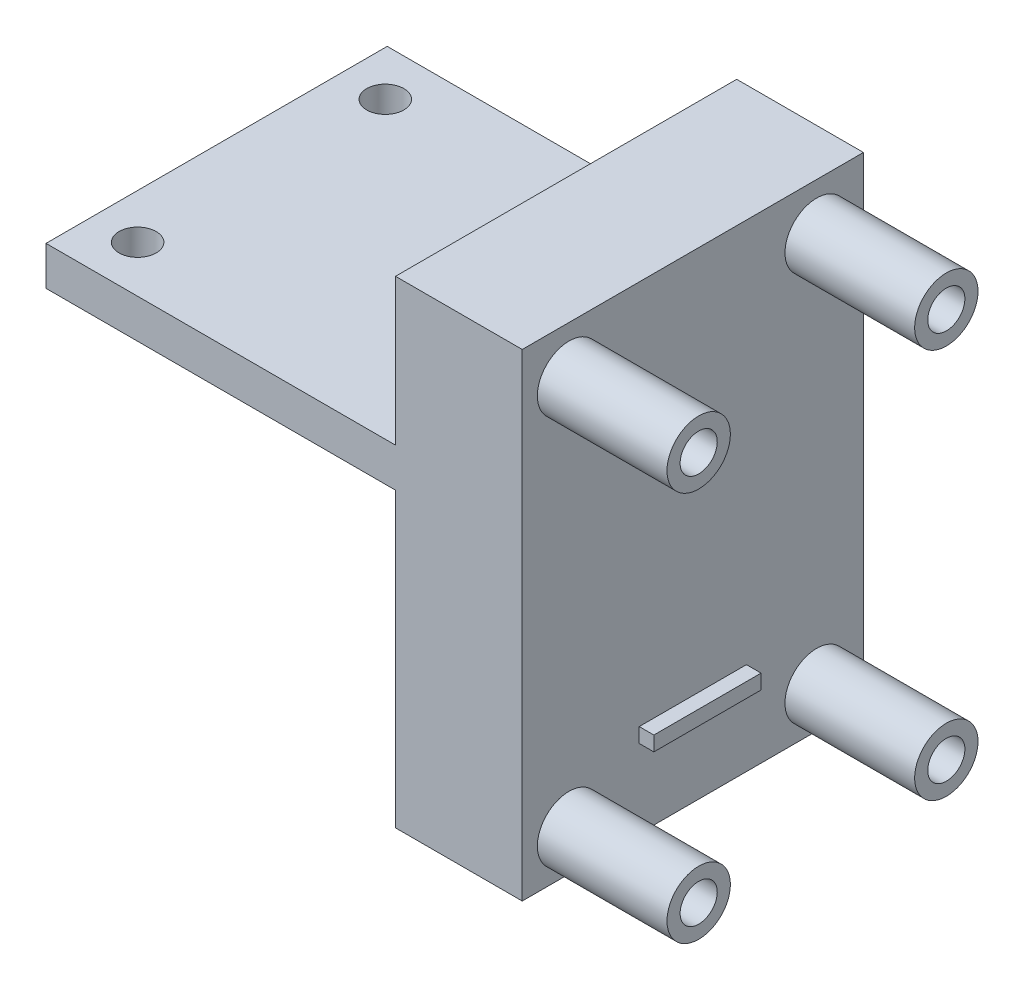
ISO-10303-21;
HEADER;
FILE_DESCRIPTION(('STEP AP214'),'2;1');
FILE_NAME('part.step','',(''),(''),'','','');
FILE_SCHEMA(('AUTOMOTIVE_DESIGN { 1 0 10303 214 1 1 1 1 }'));
ENDSEC;
DATA;
#1=APPLICATION_CONTEXT('core data for automotive mechanical design processes');
#2=APPLICATION_PROTOCOL_DEFINITION('international standard','automotive_design',2000,#1);
#3=PRODUCT_CONTEXT('',#1,'mechanical');
#4=PRODUCT('Part','Part','',(#3));
#5=PRODUCT_RELATED_PRODUCT_CATEGORY('part','',(#4));
#6=PRODUCT_DEFINITION_FORMATION('','',#4);
#7=PRODUCT_DEFINITION_CONTEXT('part definition',#1,'design');
#8=PRODUCT_DEFINITION('design','',#6,#7);
#9=PRODUCT_DEFINITION_SHAPE('','',#8);
#10=(LENGTH_UNIT() NAMED_UNIT(*) SI_UNIT(.MILLI.,.METRE.));
#11=(NAMED_UNIT(*) PLANE_ANGLE_UNIT() SI_UNIT($,.RADIAN.));
#12=(NAMED_UNIT(*) SI_UNIT($,.STERADIAN.) SOLID_ANGLE_UNIT());
#13=UNCERTAINTY_MEASURE_WITH_UNIT(LENGTH_MEASURE(1.E-05),#10,'distance_accuracy_value','');
#14=(GEOMETRIC_REPRESENTATION_CONTEXT(3) GLOBAL_UNCERTAINTY_ASSIGNED_CONTEXT((#13)) GLOBAL_UNIT_ASSIGNED_CONTEXT((#10,
#11,#12)) REPRESENTATION_CONTEXT('',''));
#15=CARTESIAN_POINT('',(0.,0.,0.));
#16=DIRECTION('',(0.,0.,1.));
#17=DIRECTION('',(1.,0.,0.));
#18=AXIS2_PLACEMENT_3D('',#15,#16,#17);
#19=CARTESIAN_POINT('',(13.,34.,-35.));
#20=DIRECTION('',(-1.,0.,0.));
#21=DIRECTION('',(0.,-1.,0.));
#22=AXIS2_PLACEMENT_3D('',#19,#20,#21);
#23=PLANE('',#22);
#24=CARTESIAN_POINT('',(13.,4.1,-30.2));
#25=DIRECTION('',(-1.,0.,0.));
#26=DIRECTION('',(0.,-1.,0.));
#27=AXIS2_PLACEMENT_3D('',#24,#25,#26);
#28=CIRCLE('',#27,3.25);
#29=CARTESIAN_POINT('',(13.,0.850000000000002,-30.2));
#30=VERTEX_POINT('',#29);
#31=EDGE_CURVE('E50',#30,#30,#28,.F.);
#32=ORIENTED_EDGE('',*,*,#31,.F.);
#33=EDGE_LOOP('',(#32));
#34=FACE_BOUND('',#33,.T.);
#35=CARTESIAN_POINT('',(13.,44.1,-4.8));
#36=DIRECTION('',(-1.,0.,0.));
#37=DIRECTION('',(0.,-1.,0.));
#38=AXIS2_PLACEMENT_3D('',#35,#36,#37);
#39=CIRCLE('',#38,3.25);
#40=CARTESIAN_POINT('',(13.,40.85,-4.8));
#41=VERTEX_POINT('',#40);
#42=EDGE_CURVE('E263',#41,#41,#39,.F.);
#43=ORIENTED_EDGE('',*,*,#42,.F.);
#44=EDGE_LOOP('',(#43));
#45=FACE_BOUND('',#44,.T.);
#46=DIRECTION('',(0.,-1.,0.));
#47=VECTOR('',#46,1.);
#48=CARTESIAN_POINT('',(13.,34.,0.));
#49=LINE('',#48,#47);
#50=CARTESIAN_POINT('',(13.,49.,0.));
#51=VERTEX_POINT('',#50);
#52=CARTESIAN_POINT('',(13.,0.,0.));
#53=VERTEX_POINT('',#52);
#54=EDGE_CURVE('E182',#51,#53,#49,.T.);
#55=ORIENTED_EDGE('',*,*,#54,.T.);
#56=DIRECTION('',(0.,0.,1.));
#57=VECTOR('',#56,1.);
#58=CARTESIAN_POINT('',(13.,0.,-35.));
#59=LINE('',#58,#57);
#60=CARTESIAN_POINT('',(13.,0.,-35.));
#61=VERTEX_POINT('',#60);
#62=EDGE_CURVE('E261',#61,#53,#59,.T.);
#63=ORIENTED_EDGE('',*,*,#62,.F.);
#64=DIRECTION('',(0.,-1.,0.));
#65=VECTOR('',#64,1.);
#66=CARTESIAN_POINT('',(13.,49.,-35.));
#67=LINE('',#66,#65);
#68=CARTESIAN_POINT('',(13.,49.,-35.));
#69=VERTEX_POINT('',#68);
#70=EDGE_CURVE('E183',#69,#61,#67,.T.);
#71=ORIENTED_EDGE('',*,*,#70,.F.);
#72=DIRECTION('',(0.,0.,1.));
#73=VECTOR('',#72,1.);
#74=CARTESIAN_POINT('',(13.,49.,-35.));
#75=LINE('',#74,#73);
#76=EDGE_CURVE('E209',#69,#51,#75,.T.);
#77=ORIENTED_EDGE('',*,*,#76,.T.);
#78=EDGE_LOOP('',(#55,#63,#71,#77));
#79=FACE_BOUND('',#78,.T.);
#80=DIRECTION('',(0.,-1.,0.));
#81=VECTOR('',#80,1.);
#82=CARTESIAN_POINT('',(13.,9.5,-12.));
#83=LINE('',#82,#81);
#84=CARTESIAN_POINT('',(13.,9.5,-12.));
#85=VERTEX_POINT('',#84);
#86=CARTESIAN_POINT('',(13.,8.,-12.));
#87=VERTEX_POINT('',#86);
#88=EDGE_CURVE('E153',#85,#87,#83,.T.);
#89=ORIENTED_EDGE('',*,*,#88,.F.);
#90=DIRECTION('',(0.,0.,1.));
#91=VECTOR('',#90,1.);
#92=CARTESIAN_POINT('',(13.,9.5,-23.));
#93=LINE('',#92,#91);
#94=CARTESIAN_POINT('',(13.,9.5,-23.));
#95=VERTEX_POINT('',#94);
#96=EDGE_CURVE('E150',#95,#85,#93,.T.);
#97=ORIENTED_EDGE('',*,*,#96,.F.);
#98=DIRECTION('',(0.,1.,0.));
#99=VECTOR('',#98,1.);
#100=CARTESIAN_POINT('',(13.,8.,-23.));
#101=LINE('',#100,#99);
#102=CARTESIAN_POINT('',(13.,8.,-23.));
#103=VERTEX_POINT('',#102);
#104=EDGE_CURVE('E62',#103,#95,#101,.T.);
#105=ORIENTED_EDGE('',*,*,#104,.F.);
#106=DIRECTION('',(0.,0.,-1.));
#107=VECTOR('',#106,1.);
#108=CARTESIAN_POINT('',(13.,8.,-12.));
#109=LINE('',#108,#107);
#110=EDGE_CURVE('E57',#87,#103,#109,.T.);
#111=ORIENTED_EDGE('',*,*,#110,.F.);
#112=EDGE_LOOP('',(#89,#97,#105,#111));
#113=FACE_BOUND('',#112,.T.);
#114=CARTESIAN_POINT('',(13.,44.1,-30.2));
#115=DIRECTION('',(-1.,0.,0.));
#116=DIRECTION('',(0.,-1.,0.));
#117=AXIS2_PLACEMENT_3D('',#114,#115,#116);
#118=CIRCLE('',#117,3.25);
#119=CARTESIAN_POINT('',(13.,40.85,-30.2));
#120=VERTEX_POINT('',#119);
#121=EDGE_CURVE('E280',#120,#120,#118,.F.);
#122=ORIENTED_EDGE('',*,*,#121,.F.);
#123=EDGE_LOOP('',(#122));
#124=FACE_BOUND('',#123,.T.);
#125=CARTESIAN_POINT('',(13.,4.1,-4.8));
#126=DIRECTION('',(-1.,0.,0.));
#127=DIRECTION('',(0.,-1.,0.));
#128=AXIS2_PLACEMENT_3D('',#125,#126,#127);
#129=CIRCLE('',#128,3.25);
#130=CARTESIAN_POINT('',(13.,0.850000000000004,-4.8));
#131=VERTEX_POINT('',#130);
#132=EDGE_CURVE('E11',#131,#131,#129,.F.);
#133=ORIENTED_EDGE('',*,*,#132,.F.);
#134=EDGE_LOOP('',(#133));
#135=FACE_BOUND('',#134,.T.);
#136=ADVANCED_FACE('F42',(#34,#45,#79,#113,#124,#135),#23,.F.);
#137=CARTESIAN_POINT('',(0.,0.,-35.));
#138=DIRECTION('',(0.,-1.,0.));
#139=DIRECTION('',(0.,0.,-1.));
#140=AXIS2_PLACEMENT_3D('',#137,#138,#139);
#141=PLANE('',#140);
#142=DIRECTION('',(1.,0.,0.));
#143=VECTOR('',#142,1.);
#144=CARTESIAN_POINT('',(0.,0.,0.));
#145=LINE('',#144,#143);
#146=CARTESIAN_POINT('',(0.,0.,0.));
#147=VERTEX_POINT('',#146);
#148=EDGE_CURVE('E213',#147,#53,#145,.T.);
#149=ORIENTED_EDGE('',*,*,#148,.F.);
#150=DIRECTION('',(0.,0.,1.));
#151=VECTOR('',#150,1.);
#152=CARTESIAN_POINT('',(0.,0.,-35.));
#153=LINE('',#152,#151);
#154=CARTESIAN_POINT('',(0.,0.,-35.));
#155=VERTEX_POINT('',#154);
#156=EDGE_CURVE('E258',#155,#147,#153,.T.);
#157=ORIENTED_EDGE('',*,*,#156,.F.);
#158=DIRECTION('',(1.,0.,0.));
#159=VECTOR('',#158,1.);
#160=CARTESIAN_POINT('',(0.,0.,-35.));
#161=LINE('',#160,#159);
#162=EDGE_CURVE('E186',#155,#61,#161,.T.);
#163=ORIENTED_EDGE('',*,*,#162,.T.);
#164=ORIENTED_EDGE('',*,*,#62,.T.);
#165=EDGE_LOOP('',(#149,#157,#163,#164));
#166=FACE_BOUND('',#165,.T.);
#167=ADVANCED_FACE('F291',(#166),#141,.T.);
#168=CARTESIAN_POINT('',(0.,0.,-35.));
#169=DIRECTION('',(1.,0.,0.));
#170=DIRECTION('',(0.,0.,-1.));
#171=AXIS2_PLACEMENT_3D('',#168,#169,#170);
#172=PLANE('',#171);
#173=CARTESIAN_POINT('',(0.,4.1,-4.8));
#174=DIRECTION('',(1.,0.,0.));
#175=DIRECTION('',(0.,0.,-1.));
#176=AXIS2_PLACEMENT_3D('',#173,#174,#175);
#177=CIRCLE('',#176,1.905);
#178=CARTESIAN_POINT('',(0.,4.1,-6.705));
#179=VERTEX_POINT('',#178);
#180=EDGE_CURVE('E160',#179,#179,#177,.T.);
#181=ORIENTED_EDGE('',*,*,#180,.T.);
#182=EDGE_LOOP('',(#181));
#183=FACE_BOUND('',#182,.T.);
#184=CARTESIAN_POINT('',(0.,4.1,-30.2));
#185=DIRECTION('',(1.,0.,0.));
#186=DIRECTION('',(0.,0.,-1.));
#187=AXIS2_PLACEMENT_3D('',#184,#185,#186);
#188=CIRCLE('',#187,1.905);
#189=CARTESIAN_POINT('',(0.,4.1,-32.105));
#190=VERTEX_POINT('',#189);
#191=EDGE_CURVE('E155',#190,#190,#188,.T.);
#192=ORIENTED_EDGE('',*,*,#191,.T.);
#193=EDGE_LOOP('',(#192));
#194=FACE_BOUND('',#193,.T.);
#195=DIRECTION('',(0.,1.,0.));
#196=VECTOR('',#195,1.);
#197=CARTESIAN_POINT('',(0.,0.,0.));
#198=LINE('',#197,#196);
#199=CARTESIAN_POINT('',(0.,30.,0.));
#200=VERTEX_POINT('',#199);
#201=EDGE_CURVE('E217',#147,#200,#198,.T.);
#202=ORIENTED_EDGE('',*,*,#201,.T.);
#203=DIRECTION('',(0.,0.,1.));
#204=VECTOR('',#203,1.);
#205=CARTESIAN_POINT('',(0.,30.,-35.));
#206=LINE('',#205,#204);
#207=CARTESIAN_POINT('',(0.,30.,-35.));
#208=VERTEX_POINT('',#207);
#209=EDGE_CURVE('E254',#208,#200,#206,.T.);
#210=ORIENTED_EDGE('',*,*,#209,.F.);
#211=DIRECTION('',(0.,1.,0.));
#212=VECTOR('',#211,1.);
#213=CARTESIAN_POINT('',(0.,0.,-35.));
#214=LINE('',#213,#212);
#215=EDGE_CURVE('E191',#155,#208,#214,.T.);
#216=ORIENTED_EDGE('',*,*,#215,.F.);
#217=ORIENTED_EDGE('',*,*,#156,.T.);
#218=EDGE_LOOP('',(#202,#210,#216,#217));
#219=FACE_BOUND('',#218,.T.);
#220=ADVANCED_FACE('F401',(#183,#194,#219),#172,.F.);
#221=CARTESIAN_POINT('',(0.,30.,-35.));
#222=DIRECTION('',(0.,1.,0.));
#223=DIRECTION('',(-1.,0.,0.));
#224=AXIS2_PLACEMENT_3D('',#221,#222,#223);
#225=PLANE('',#224);
#226=CARTESIAN_POINT('',(-31.25,30.,-4.8));
#227=DIRECTION('',(0.,1.,0.));
#228=DIRECTION('',(-1.,0.,0.));
#229=AXIS2_PLACEMENT_3D('',#226,#227,#228);
#230=CIRCLE('',#229,1.905);
#231=CARTESIAN_POINT('',(-33.155,30.,-4.8));
#232=VERTEX_POINT('',#231);
#233=EDGE_CURVE('E178',#232,#232,#230,.T.);
#234=ORIENTED_EDGE('',*,*,#233,.T.);
#235=EDGE_LOOP('',(#234));
#236=FACE_BOUND('',#235,.T.);
#237=CARTESIAN_POINT('',(-31.25,30.,-30.2));
#238=DIRECTION('',(0.,1.,0.));
#239=DIRECTION('',(-1.,0.,0.));
#240=AXIS2_PLACEMENT_3D('',#237,#238,#239);
#241=CIRCLE('',#240,1.905);
#242=CARTESIAN_POINT('',(-33.155,30.,-30.2));
#243=VERTEX_POINT('',#242);
#244=EDGE_CURVE('E170',#243,#243,#241,.T.);
#245=ORIENTED_EDGE('',*,*,#244,.T.);
#246=EDGE_LOOP('',(#245));
#247=FACE_BOUND('',#246,.T.);
#248=DIRECTION('',(-1.,0.,0.));
#249=VECTOR('',#248,1.);
#250=CARTESIAN_POINT('',(0.,30.,0.));
#251=LINE('',#250,#249);
#252=CARTESIAN_POINT('',(-35.85,30.,0.));
#253=VERTEX_POINT('',#252);
#254=EDGE_CURVE('E220',#200,#253,#251,.T.);
#255=ORIENTED_EDGE('',*,*,#254,.T.);
#256=DIRECTION('',(0.,0.,1.));
#257=VECTOR('',#256,1.);
#258=CARTESIAN_POINT('',(-35.85,30.,-35.));
#259=LINE('',#258,#257);
#260=CARTESIAN_POINT('',(-35.85,30.,-35.));
#261=VERTEX_POINT('',#260);
#262=EDGE_CURVE('E250',#261,#253,#259,.T.);
#263=ORIENTED_EDGE('',*,*,#262,.F.);
#264=DIRECTION('',(-1.,0.,0.));
#265=VECTOR('',#264,1.);
#266=CARTESIAN_POINT('',(0.,30.,-35.));
#267=LINE('',#266,#265);
#268=EDGE_CURVE('E194',#208,#261,#267,.T.);
#269=ORIENTED_EDGE('',*,*,#268,.F.);
#270=ORIENTED_EDGE('',*,*,#209,.T.);
#271=EDGE_LOOP('',(#255,#263,#269,#270));
#272=FACE_BOUND('',#271,.T.);
#273=ADVANCED_FACE('F397',(#236,#247,#272),#225,.F.);
#274=CARTESIAN_POINT('',(-35.85,30.,-35.));
#275=DIRECTION('',(1.,0.,0.));
#276=DIRECTION('',(0.,0.,-1.));
#277=AXIS2_PLACEMENT_3D('',#274,#275,#276);
#278=PLANE('',#277);
#279=DIRECTION('',(0.,1.,0.));
#280=VECTOR('',#279,1.);
#281=CARTESIAN_POINT('',(-35.85,30.,0.));
#282=LINE('',#281,#280);
#283=CARTESIAN_POINT('',(-35.85,34.,0.));
#284=VERTEX_POINT('',#283);
#285=EDGE_CURVE('E223',#253,#284,#282,.T.);
#286=ORIENTED_EDGE('',*,*,#285,.T.);
#287=DIRECTION('',(0.,0.,1.));
#288=VECTOR('',#287,1.);
#289=CARTESIAN_POINT('',(-35.85,34.,-35.));
#290=LINE('',#289,#288);
#291=CARTESIAN_POINT('',(-35.85,34.,-35.));
#292=VERTEX_POINT('',#291);
#293=EDGE_CURVE('E246',#292,#284,#290,.T.);
#294=ORIENTED_EDGE('',*,*,#293,.F.);
#295=DIRECTION('',(0.,1.,0.));
#296=VECTOR('',#295,1.);
#297=CARTESIAN_POINT('',(-35.85,30.,-35.));
#298=LINE('',#297,#296);
#299=EDGE_CURVE('E197',#261,#292,#298,.T.);
#300=ORIENTED_EDGE('',*,*,#299,.F.);
#301=ORIENTED_EDGE('',*,*,#262,.T.);
#302=EDGE_LOOP('',(#286,#294,#300,#301));
#303=FACE_BOUND('',#302,.T.);
#304=ADVANCED_FACE('F393',(#303),#278,.F.);
#305=CARTESIAN_POINT('',(-35.85,34.,-35.));
#306=DIRECTION('',(0.,-1.,0.));
#307=DIRECTION('',(1.,0.,0.));
#308=AXIS2_PLACEMENT_3D('',#305,#306,#307);
#309=PLANE('',#308);
#310=CARTESIAN_POINT('',(-31.25,34.,-4.8));
#311=DIRECTION('',(0.,1.,0.));
#312=DIRECTION('',(0.,0.,1.));
#313=AXIS2_PLACEMENT_3D('',#310,#311,#312);
#314=CIRCLE('',#313,1.905);
#315=CARTESIAN_POINT('',(-31.25,34.,-2.895));
#316=VERTEX_POINT('',#315);
#317=EDGE_CURVE('E166',#316,#316,#314,.T.);
#318=ORIENTED_EDGE('',*,*,#317,.F.);
#319=EDGE_LOOP('',(#318));
#320=FACE_BOUND('',#319,.T.);
#321=CARTESIAN_POINT('',(-31.25,34.,-30.2));
#322=DIRECTION('',(0.,1.,0.));
#323=DIRECTION('',(0.,0.,1.));
#324=AXIS2_PLACEMENT_3D('',#321,#322,#323);
#325=CIRCLE('',#324,1.905);
#326=CARTESIAN_POINT('',(-31.25,34.,-28.295));
#327=VERTEX_POINT('',#326);
#328=EDGE_CURVE('E171',#327,#327,#325,.T.);
#329=ORIENTED_EDGE('',*,*,#328,.F.);
#330=EDGE_LOOP('',(#329));
#331=FACE_BOUND('',#330,.T.);
#332=DIRECTION('',(1.,0.,0.));
#333=VECTOR('',#332,1.);
#334=CARTESIAN_POINT('',(-35.85,34.,0.));
#335=LINE('',#334,#333);
#336=CARTESIAN_POINT('',(0.,34.,0.));
#337=VERTEX_POINT('',#336);
#338=EDGE_CURVE('E226',#284,#337,#335,.T.);
#339=ORIENTED_EDGE('',*,*,#338,.T.);
#340=DIRECTION('',(0.,0.,1.));
#341=VECTOR('',#340,1.);
#342=CARTESIAN_POINT('',(0.,34.,-35.));
#343=LINE('',#342,#341);
#344=CARTESIAN_POINT('',(0.,34.,-35.));
#345=VERTEX_POINT('',#344);
#346=EDGE_CURVE('E242',#345,#337,#343,.T.);
#347=ORIENTED_EDGE('',*,*,#346,.F.);
#348=DIRECTION('',(1.,0.,0.));
#349=VECTOR('',#348,1.);
#350=CARTESIAN_POINT('',(-35.85,34.,-35.));
#351=LINE('',#350,#349);
#352=EDGE_CURVE('E200',#292,#345,#351,.T.);
#353=ORIENTED_EDGE('',*,*,#352,.F.);
#354=ORIENTED_EDGE('',*,*,#293,.T.);
#355=EDGE_LOOP('',(#339,#347,#353,#354));
#356=FACE_BOUND('',#355,.T.);
#357=ADVANCED_FACE('F389',(#320,#331,#356),#309,.F.);
#358=CARTESIAN_POINT('',(0.,34.,-35.));
#359=DIRECTION('',(1.,0.,0.));
#360=DIRECTION('',(0.,1.,0.));
#361=AXIS2_PLACEMENT_3D('',#358,#359,#360);
#362=PLANE('',#361);
#363=CARTESIAN_POINT('',(0.,44.1,-4.8));
#364=DIRECTION('',(1.,0.,0.));
#365=DIRECTION('',(0.,1.,0.));
#366=AXIS2_PLACEMENT_3D('',#363,#364,#365);
#367=CIRCLE('',#366,1.905);
#368=CARTESIAN_POINT('',(0.,46.005,-4.8));
#369=VERTEX_POINT('',#368);
#370=EDGE_CURVE('E272',#369,#369,#367,.T.);
#371=ORIENTED_EDGE('',*,*,#370,.T.);
#372=EDGE_LOOP('',(#371));
#373=FACE_BOUND('',#372,.T.);
#374=CARTESIAN_POINT('',(0.,44.1,-30.2));
#375=DIRECTION('',(1.,0.,0.));
#376=DIRECTION('',(0.,1.,0.));
#377=AXIS2_PLACEMENT_3D('',#374,#375,#376);
#378=CIRCLE('',#377,1.905);
#379=CARTESIAN_POINT('',(0.,46.005,-30.2));
#380=VERTEX_POINT('',#379);
#381=EDGE_CURVE('E268',#380,#380,#378,.T.);
#382=ORIENTED_EDGE('',*,*,#381,.T.);
#383=EDGE_LOOP('',(#382));
#384=FACE_BOUND('',#383,.T.);
#385=DIRECTION('',(0.,1.,0.));
#386=VECTOR('',#385,1.);
#387=CARTESIAN_POINT('',(0.,34.,0.));
#388=LINE('',#387,#386);
#389=CARTESIAN_POINT('',(0.,49.,0.));
#390=VERTEX_POINT('',#389);
#391=EDGE_CURVE('E229',#337,#390,#388,.T.);
#392=ORIENTED_EDGE('',*,*,#391,.T.);
#393=DIRECTION('',(0.,0.,1.));
#394=VECTOR('',#393,1.);
#395=CARTESIAN_POINT('',(0.,49.,-35.));
#396=LINE('',#395,#394);
#397=CARTESIAN_POINT('',(0.,49.,-35.));
#398=VERTEX_POINT('',#397);
#399=EDGE_CURVE('E238',#398,#390,#396,.T.);
#400=ORIENTED_EDGE('',*,*,#399,.F.);
#401=DIRECTION('',(0.,1.,0.));
#402=VECTOR('',#401,1.);
#403=CARTESIAN_POINT('',(0.,34.,-35.));
#404=LINE('',#403,#402);
#405=EDGE_CURVE('E203',#345,#398,#404,.T.);
#406=ORIENTED_EDGE('',*,*,#405,.F.);
#407=ORIENTED_EDGE('',*,*,#346,.T.);
#408=EDGE_LOOP('',(#392,#400,#406,#407));
#409=FACE_BOUND('',#408,.T.);
#410=ADVANCED_FACE('F385',(#373,#384,#409),#362,.F.);
#411=CARTESIAN_POINT('',(0.,49.,-35.));
#412=DIRECTION('',(0.,-1.,0.));
#413=DIRECTION('',(0.,0.,-1.));
#414=AXIS2_PLACEMENT_3D('',#411,#412,#413);
#415=PLANE('',#414);
#416=DIRECTION('',(1.,0.,0.));
#417=VECTOR('',#416,1.);
#418=CARTESIAN_POINT('',(0.,49.,0.));
#419=LINE('',#418,#417);
#420=EDGE_CURVE('E187',#390,#51,#419,.T.);
#421=ORIENTED_EDGE('',*,*,#420,.T.);
#422=ORIENTED_EDGE('',*,*,#76,.F.);
#423=DIRECTION('',(1.,0.,0.));
#424=VECTOR('',#423,1.);
#425=CARTESIAN_POINT('',(0.,49.,-35.));
#426=LINE('',#425,#424);
#427=EDGE_CURVE('E206',#398,#69,#426,.T.);
#428=ORIENTED_EDGE('',*,*,#427,.F.);
#429=ORIENTED_EDGE('',*,*,#399,.T.);
#430=EDGE_LOOP('',(#421,#422,#428,#429));
#431=FACE_BOUND('',#430,.T.);
#432=ADVANCED_FACE('F378',(#431),#415,.F.);
#433=CARTESIAN_POINT('',(0.,0.,-35.));
#434=DIRECTION('',(0.,0.,1.));
#435=DIRECTION('',(1.,0.,0.));
#436=AXIS2_PLACEMENT_3D('',#433,#434,#435);
#437=PLANE('',#436);
#438=ORIENTED_EDGE('',*,*,#70,.T.);
#439=ORIENTED_EDGE('',*,*,#162,.F.);
#440=ORIENTED_EDGE('',*,*,#215,.T.);
#441=ORIENTED_EDGE('',*,*,#268,.T.);
#442=ORIENTED_EDGE('',*,*,#299,.T.);
#443=ORIENTED_EDGE('',*,*,#352,.T.);
#444=ORIENTED_EDGE('',*,*,#405,.T.);
#445=ORIENTED_EDGE('',*,*,#427,.T.);
#446=EDGE_LOOP('',(#438,#439,#440,#441,#442,#443,#444,#445));
#447=FACE_BOUND('',#446,.T.);
#448=ADVANCED_FACE('F375',(#447),#437,.F.);
#449=CARTESIAN_POINT('',(0.,0.,0.));
#450=DIRECTION('',(0.,0.,1.));
#451=DIRECTION('',(1.,0.,0.));
#452=AXIS2_PLACEMENT_3D('',#449,#450,#451);
#453=PLANE('',#452);
#454=ORIENTED_EDGE('',*,*,#54,.F.);
#455=ORIENTED_EDGE('',*,*,#420,.F.);
#456=ORIENTED_EDGE('',*,*,#391,.F.);
#457=ORIENTED_EDGE('',*,*,#338,.F.);
#458=ORIENTED_EDGE('',*,*,#285,.F.);
#459=ORIENTED_EDGE('',*,*,#254,.F.);
#460=ORIENTED_EDGE('',*,*,#201,.F.);
#461=ORIENTED_EDGE('',*,*,#148,.T.);
#462=EDGE_LOOP('',(#454,#455,#456,#457,#458,#459,#460,#461));
#463=FACE_BOUND('',#462,.T.);
#464=ADVANCED_FACE('F373',(#463),#453,.T.);
#465=CARTESIAN_POINT('',(-31.25,0.,-30.2));
#466=DIRECTION('',(0.,1.,0.));
#467=DIRECTION('',(0.,0.,1.));
#468=AXIS2_PLACEMENT_3D('',#465,#466,#467);
#469=CYLINDRICAL_SURFACE('',#468,1.905);
#470=ORIENTED_EDGE('',*,*,#328,.T.);
#471=EDGE_LOOP('',(#470));
#472=FACE_BOUND('',#471,.T.);
#473=ORIENTED_EDGE('',*,*,#244,.F.);
#474=EDGE_LOOP('',(#473));
#475=FACE_BOUND('',#474,.T.);
#476=ADVANCED_FACE('F369',(#472,#475),#469,.F.);
#477=CARTESIAN_POINT('',(-31.25,0.,-4.8));
#478=DIRECTION('',(0.,1.,0.));
#479=DIRECTION('',(0.,0.,1.));
#480=AXIS2_PLACEMENT_3D('',#477,#478,#479);
#481=CYLINDRICAL_SURFACE('',#480,1.905);
#482=ORIENTED_EDGE('',*,*,#317,.T.);
#483=EDGE_LOOP('',(#482));
#484=FACE_BOUND('',#483,.T.);
#485=ORIENTED_EDGE('',*,*,#233,.F.);
#486=EDGE_LOOP('',(#485));
#487=FACE_BOUND('',#486,.T.);
#488=ADVANCED_FACE('F365',(#484,#487),#481,.F.);
#489=CARTESIAN_POINT('',(-35.85,4.1,-30.2));
#490=DIRECTION('',(1.,0.,0.));
#491=DIRECTION('',(0.,1.,0.));
#492=AXIS2_PLACEMENT_3D('',#489,#490,#491);
#493=CYLINDRICAL_SURFACE('',#492,1.905);
#494=ORIENTED_EDGE('',*,*,#191,.F.);
#495=EDGE_LOOP('',(#494));
#496=FACE_BOUND('',#495,.T.);
#497=CARTESIAN_POINT('',(26.3,4.10000000000001,-30.2));
#498=DIRECTION('',(1.,0.,0.));
#499=DIRECTION('',(0.,1.,0.));
#500=AXIS2_PLACEMENT_3D('',#497,#498,#499);
#501=CIRCLE('',#500,1.905);
#502=CARTESIAN_POINT('',(26.3,6.00500000000001,-30.2));
#503=VERTEX_POINT('',#502);
#504=EDGE_CURVE('E683',#503,#503,#501,.T.);
#505=ORIENTED_EDGE('',*,*,#504,.T.);
#506=EDGE_LOOP('',(#505));
#507=FACE_BOUND('',#506,.T.);
#508=ADVANCED_FACE('F361',(#496,#507),#493,.F.);
#509=CARTESIAN_POINT('',(-35.85,4.1,-4.8));
#510=DIRECTION('',(1.,0.,0.));
#511=DIRECTION('',(0.,1.,0.));
#512=AXIS2_PLACEMENT_3D('',#509,#510,#511);
#513=CYLINDRICAL_SURFACE('',#512,1.905);
#514=ORIENTED_EDGE('',*,*,#180,.F.);
#515=EDGE_LOOP('',(#514));
#516=FACE_BOUND('',#515,.T.);
#517=CARTESIAN_POINT('',(26.3,4.10000000000001,-4.8));
#518=DIRECTION('',(1.,0.,0.));
#519=DIRECTION('',(0.,1.,0.));
#520=AXIS2_PLACEMENT_3D('',#517,#518,#519);
#521=CIRCLE('',#520,1.905);
#522=CARTESIAN_POINT('',(26.3,6.00500000000001,-4.8));
#523=VERTEX_POINT('',#522);
#524=EDGE_CURVE('E695',#523,#523,#521,.T.);
#525=ORIENTED_EDGE('',*,*,#524,.T.);
#526=EDGE_LOOP('',(#525));
#527=FACE_BOUND('',#526,.T.);
#528=ADVANCED_FACE('F358',(#516,#527),#513,.F.);
#529=CARTESIAN_POINT('',(14.5,9.5,-12.));
#530=DIRECTION('',(0.,0.,-1.));
#531=DIRECTION('',(-1.,0.,0.));
#532=AXIS2_PLACEMENT_3D('',#529,#530,#531);
#533=PLANE('',#532);
#534=ORIENTED_EDGE('',*,*,#88,.T.);
#535=DIRECTION('',(-1.,0.,0.));
#536=VECTOR('',#535,1.);
#537=CARTESIAN_POINT('',(14.5,8.,-12.));
#538=LINE('',#537,#536);
#539=CARTESIAN_POINT('',(14.5,8.,-12.));
#540=VERTEX_POINT('',#539);
#541=EDGE_CURVE('E132',#540,#87,#538,.T.);
#542=ORIENTED_EDGE('',*,*,#541,.F.);
#543=DIRECTION('',(0.,-1.,0.));
#544=VECTOR('',#543,1.);
#545=CARTESIAN_POINT('',(14.5,9.5,-12.));
#546=LINE('',#545,#544);
#547=CARTESIAN_POINT('',(14.5,9.5,-12.));
#548=VERTEX_POINT('',#547);
#549=EDGE_CURVE('E140',#548,#540,#546,.T.);
#550=ORIENTED_EDGE('',*,*,#549,.F.);
#551=DIRECTION('',(-1.,0.,0.));
#552=VECTOR('',#551,1.);
#553=CARTESIAN_POINT('',(14.5,9.5,-12.));
#554=LINE('',#553,#552);
#555=EDGE_CURVE('E713',#548,#85,#554,.T.);
#556=ORIENTED_EDGE('',*,*,#555,.T.);
#557=EDGE_LOOP('',(#534,#542,#550,#556));
#558=FACE_BOUND('',#557,.T.);
#559=ADVANCED_FACE('F152',(#558),#533,.F.);
#560=CARTESIAN_POINT('',(14.5,8.,-12.));
#561=DIRECTION('',(0.,1.,0.));
#562=DIRECTION('',(-1.,0.,0.));
#563=AXIS2_PLACEMENT_3D('',#560,#561,#562);
#564=PLANE('',#563);
#565=ORIENTED_EDGE('',*,*,#110,.T.);
#566=DIRECTION('',(-1.,0.,0.));
#567=VECTOR('',#566,1.);
#568=CARTESIAN_POINT('',(14.5,8.,-23.));
#569=LINE('',#568,#567);
#570=CARTESIAN_POINT('',(14.5,8.,-23.));
#571=VERTEX_POINT('',#570);
#572=EDGE_CURVE('E135',#571,#103,#569,.T.);
#573=ORIENTED_EDGE('',*,*,#572,.F.);
#574=DIRECTION('',(0.,0.,-1.));
#575=VECTOR('',#574,1.);
#576=CARTESIAN_POINT('',(14.5,8.,-12.));
#577=LINE('',#576,#575);
#578=EDGE_CURVE('E128',#540,#571,#577,.T.);
#579=ORIENTED_EDGE('',*,*,#578,.F.);
#580=ORIENTED_EDGE('',*,*,#541,.T.);
#581=EDGE_LOOP('',(#565,#573,#579,#580));
#582=FACE_BOUND('',#581,.T.);
#583=ADVANCED_FACE('F130',(#582),#564,.F.);
#584=CARTESIAN_POINT('',(14.5,8.,-23.));
#585=DIRECTION('',(0.,0.,1.));
#586=DIRECTION('',(0.,-1.,0.));
#587=AXIS2_PLACEMENT_3D('',#584,#585,#586);
#588=PLANE('',#587);
#589=ORIENTED_EDGE('',*,*,#104,.T.);
#590=DIRECTION('',(-1.,0.,0.));
#591=VECTOR('',#590,1.);
#592=CARTESIAN_POINT('',(14.5,9.5,-23.));
#593=LINE('',#592,#591);
#594=CARTESIAN_POINT('',(14.5,9.5,-23.));
#595=VERTEX_POINT('',#594);
#596=EDGE_CURVE('E162',#595,#95,#593,.T.);
#597=ORIENTED_EDGE('',*,*,#596,.F.);
#598=DIRECTION('',(0.,1.,0.));
#599=VECTOR('',#598,1.);
#600=CARTESIAN_POINT('',(14.5,8.,-23.));
#601=LINE('',#600,#599);
#602=EDGE_CURVE('E139',#571,#595,#601,.T.);
#603=ORIENTED_EDGE('',*,*,#602,.F.);
#604=ORIENTED_EDGE('',*,*,#572,.T.);
#605=EDGE_LOOP('',(#589,#597,#603,#604));
#606=FACE_BOUND('',#605,.T.);
#607=ADVANCED_FACE('F349',(#606),#588,.F.);
#608=CARTESIAN_POINT('',(14.5,9.5,-23.));
#609=DIRECTION('',(0.,-1.,0.));
#610=DIRECTION('',(0.,0.,-1.));
#611=AXIS2_PLACEMENT_3D('',#608,#609,#610);
#612=PLANE('',#611);
#613=ORIENTED_EDGE('',*,*,#96,.T.);
#614=ORIENTED_EDGE('',*,*,#555,.F.);
#615=DIRECTION('',(0.,0.,1.));
#616=VECTOR('',#615,1.);
#617=CARTESIAN_POINT('',(14.5,9.5,-23.));
#618=LINE('',#617,#616);
#619=EDGE_CURVE('E145',#595,#548,#618,.T.);
#620=ORIENTED_EDGE('',*,*,#619,.F.);
#621=ORIENTED_EDGE('',*,*,#596,.T.);
#622=EDGE_LOOP('',(#613,#614,#620,#621));
#623=FACE_BOUND('',#622,.T.);
#624=ADVANCED_FACE('F346',(#623),#612,.F.);
#625=CARTESIAN_POINT('',(14.5,0.,0.));
#626=DIRECTION('',(1.,0.,0.));
#627=DIRECTION('',(0.,0.,-1.));
#628=AXIS2_PLACEMENT_3D('',#625,#626,#627);
#629=PLANE('',#628);
#630=ORIENTED_EDGE('',*,*,#549,.T.);
#631=ORIENTED_EDGE('',*,*,#578,.T.);
#632=ORIENTED_EDGE('',*,*,#602,.T.);
#633=ORIENTED_EDGE('',*,*,#619,.T.);
#634=EDGE_LOOP('',(#630,#631,#632,#633));
#635=FACE_BOUND('',#634,.T.);
#636=ADVANCED_FACE('F143',(#635),#629,.T.);
#637=CARTESIAN_POINT('',(-35.85,44.1,-30.2));
#638=DIRECTION('',(1.,0.,0.));
#639=DIRECTION('',(0.,1.,0.));
#640=AXIS2_PLACEMENT_3D('',#637,#638,#639);
#641=CYLINDRICAL_SURFACE('',#640,1.905);
#642=ORIENTED_EDGE('',*,*,#381,.F.);
#643=EDGE_LOOP('',(#642));
#644=FACE_BOUND('',#643,.T.);
#645=CARTESIAN_POINT('',(26.3,44.1,-30.2));
#646=DIRECTION('',(1.,0.,0.));
#647=DIRECTION('',(0.,1.,0.));
#648=AXIS2_PLACEMENT_3D('',#645,#646,#647);
#649=CIRCLE('',#648,1.905);
#650=CARTESIAN_POINT('',(26.3,46.005,-30.2));
#651=VERTEX_POINT('',#650);
#652=EDGE_CURVE('E692',#651,#651,#649,.T.);
#653=ORIENTED_EDGE('',*,*,#652,.T.);
#654=EDGE_LOOP('',(#653));
#655=FACE_BOUND('',#654,.T.);
#656=ADVANCED_FACE('F339',(#644,#655),#641,.F.);
#657=CARTESIAN_POINT('',(-35.85,44.1,-4.8));
#658=DIRECTION('',(1.,0.,0.));
#659=DIRECTION('',(0.,1.,0.));
#660=AXIS2_PLACEMENT_3D('',#657,#658,#659);
#661=CYLINDRICAL_SURFACE('',#660,1.905);
#662=ORIENTED_EDGE('',*,*,#370,.F.);
#663=EDGE_LOOP('',(#662));
#664=FACE_BOUND('',#663,.T.);
#665=CARTESIAN_POINT('',(26.3,44.1,-4.8));
#666=DIRECTION('',(1.,0.,0.));
#667=DIRECTION('',(0.,1.,0.));
#668=AXIS2_PLACEMENT_3D('',#665,#666,#667);
#669=CIRCLE('',#668,1.905);
#670=CARTESIAN_POINT('',(26.3,46.005,-4.8));
#671=VERTEX_POINT('',#670);
#672=EDGE_CURVE('E702',#671,#671,#669,.T.);
#673=ORIENTED_EDGE('',*,*,#672,.T.);
#674=EDGE_LOOP('',(#673));
#675=FACE_BOUND('',#674,.T.);
#676=ADVANCED_FACE('F332',(#664,#675),#661,.F.);
#677=CARTESIAN_POINT('',(26.3,44.1,-4.8));
#678=DIRECTION('',(1.,0.,0.));
#679=DIRECTION('',(0.,1.,0.));
#680=AXIS2_PLACEMENT_3D('',#677,#678,#679);
#681=PLANE('',#680);
#682=CARTESIAN_POINT('',(26.3,44.1,-4.8));
#683=DIRECTION('',(1.,0.,0.));
#684=DIRECTION('',(0.,1.,0.));
#685=AXIS2_PLACEMENT_3D('',#682,#683,#684);
#686=CIRCLE('',#685,3.25);
#687=CARTESIAN_POINT('',(26.3,47.35,-4.8));
#688=VERTEX_POINT('',#687);
#689=EDGE_CURVE('E273',#688,#688,#686,.T.);
#690=ORIENTED_EDGE('',*,*,#689,.T.);
#691=EDGE_LOOP('',(#690));
#692=FACE_BOUND('',#691,.T.);
#693=ORIENTED_EDGE('',*,*,#672,.F.);
#694=EDGE_LOOP('',(#693));
#695=FACE_BOUND('',#694,.T.);
#696=ADVANCED_FACE('F329',(#692,#695),#681,.T.);
#697=CARTESIAN_POINT('',(26.3,44.1,-4.8));
#698=DIRECTION('',(-1.,0.,0.));
#699=DIRECTION('',(0.,-1.,0.));
#700=AXIS2_PLACEMENT_3D('',#697,#698,#699);
#701=CYLINDRICAL_SURFACE('',#700,3.25);
#702=ORIENTED_EDGE('',*,*,#689,.F.);
#703=EDGE_LOOP('',(#702));
#704=FACE_BOUND('',#703,.T.);
#705=ORIENTED_EDGE('',*,*,#42,.T.);
#706=EDGE_LOOP('',(#705));
#707=FACE_BOUND('',#706,.T.);
#708=ADVANCED_FACE('F327',(#704,#707),#701,.T.);
#709=CARTESIAN_POINT('',(26.3,44.1,-30.2));
#710=DIRECTION('',(1.,0.,0.));
#711=DIRECTION('',(0.,1.,0.));
#712=AXIS2_PLACEMENT_3D('',#709,#710,#711);
#713=PLANE('',#712);
#714=CARTESIAN_POINT('',(26.3,44.1,-30.2));
#715=DIRECTION('',(1.,0.,0.));
#716=DIRECTION('',(0.,1.,0.));
#717=AXIS2_PLACEMENT_3D('',#714,#715,#716);
#718=CIRCLE('',#717,3.25);
#719=CARTESIAN_POINT('',(26.3,47.35,-30.2));
#720=VERTEX_POINT('',#719);
#721=EDGE_CURVE('E686',#720,#720,#718,.T.);
#722=ORIENTED_EDGE('',*,*,#721,.T.);
#723=EDGE_LOOP('',(#722));
#724=FACE_BOUND('',#723,.T.);
#725=ORIENTED_EDGE('',*,*,#652,.F.);
#726=EDGE_LOOP('',(#725));
#727=FACE_BOUND('',#726,.T.);
#728=ADVANCED_FACE('F323',(#724,#727),#713,.T.);
#729=CARTESIAN_POINT('',(26.3,44.1,-30.2));
#730=DIRECTION('',(-1.,0.,0.));
#731=DIRECTION('',(0.,-1.,0.));
#732=AXIS2_PLACEMENT_3D('',#729,#730,#731);
#733=CYLINDRICAL_SURFACE('',#732,3.25);
#734=ORIENTED_EDGE('',*,*,#721,.F.);
#735=EDGE_LOOP('',(#734));
#736=FACE_BOUND('',#735,.T.);
#737=ORIENTED_EDGE('',*,*,#121,.T.);
#738=EDGE_LOOP('',(#737));
#739=FACE_BOUND('',#738,.T.);
#740=ADVANCED_FACE('F319',(#736,#739),#733,.T.);
#741=CARTESIAN_POINT('',(26.3,4.10000000000001,-30.2));
#742=DIRECTION('',(1.,0.,0.));
#743=DIRECTION('',(0.,1.,0.));
#744=AXIS2_PLACEMENT_3D('',#741,#742,#743);
#745=PLANE('',#744);
#746=CARTESIAN_POINT('',(26.3,4.10000000000001,-30.2));
#747=DIRECTION('',(1.,0.,0.));
#748=DIRECTION('',(0.,1.,0.));
#749=AXIS2_PLACEMENT_3D('',#746,#747,#748);
#750=CIRCLE('',#749,3.25);
#751=CARTESIAN_POINT('',(26.3,7.35000000000001,-30.2));
#752=VERTEX_POINT('',#751);
#753=EDGE_CURVE('E687',#752,#752,#750,.T.);
#754=ORIENTED_EDGE('',*,*,#753,.T.);
#755=EDGE_LOOP('',(#754));
#756=FACE_BOUND('',#755,.T.);
#757=ORIENTED_EDGE('',*,*,#504,.F.);
#758=EDGE_LOOP('',(#757));
#759=FACE_BOUND('',#758,.T.);
#760=ADVANCED_FACE('F315',(#756,#759),#745,.T.);
#761=CARTESIAN_POINT('',(26.3,4.10000000000001,-30.2));
#762=DIRECTION('',(-1.,0.,0.));
#763=DIRECTION('',(0.,-1.,0.));
#764=AXIS2_PLACEMENT_3D('',#761,#762,#763);
#765=CYLINDRICAL_SURFACE('',#764,3.25);
#766=ORIENTED_EDGE('',*,*,#753,.F.);
#767=EDGE_LOOP('',(#766));
#768=FACE_BOUND('',#767,.T.);
#769=ORIENTED_EDGE('',*,*,#31,.T.);
#770=EDGE_LOOP('',(#769));
#771=FACE_BOUND('',#770,.T.);
#772=ADVANCED_FACE('F287',(#768,#771),#765,.T.);
#773=CARTESIAN_POINT('',(26.3,4.10000000000001,-4.8));
#774=DIRECTION('',(1.,0.,0.));
#775=DIRECTION('',(0.,1.,0.));
#776=AXIS2_PLACEMENT_3D('',#773,#774,#775);
#777=PLANE('',#776);
#778=CARTESIAN_POINT('',(26.3,4.10000000000001,-4.8));
#779=DIRECTION('',(1.,0.,0.));
#780=DIRECTION('',(0.,1.,0.));
#781=AXIS2_PLACEMENT_3D('',#778,#779,#780);
#782=CIRCLE('',#781,3.25);
#783=CARTESIAN_POINT('',(26.3,7.35000000000001,-4.8));
#784=VERTEX_POINT('',#783);
#785=EDGE_CURVE('E737',#784,#784,#782,.T.);
#786=ORIENTED_EDGE('',*,*,#785,.T.);
#787=EDGE_LOOP('',(#786));
#788=FACE_BOUND('',#787,.T.);
#789=ORIENTED_EDGE('',*,*,#524,.F.);
#790=EDGE_LOOP('',(#789));
#791=FACE_BOUND('',#790,.T.);
#792=ADVANCED_FACE('F303',(#788,#791),#777,.T.);
#793=CARTESIAN_POINT('',(26.3,4.10000000000001,-4.8));
#794=DIRECTION('',(-1.,0.,0.));
#795=DIRECTION('',(0.,-1.,0.));
#796=AXIS2_PLACEMENT_3D('',#793,#794,#795);
#797=CYLINDRICAL_SURFACE('',#796,3.25);
#798=ORIENTED_EDGE('',*,*,#785,.F.);
#799=EDGE_LOOP('',(#798));
#800=FACE_BOUND('',#799,.T.);
#801=ORIENTED_EDGE('',*,*,#132,.T.);
#802=EDGE_LOOP('',(#801));
#803=FACE_BOUND('',#802,.T.);
#804=ADVANCED_FACE('F301',(#800,#803),#797,.T.);
#805=CLOSED_SHELL('',(#136,#167,#220,#273,#304,#357,#410,#432,#448,#464,#476,#488,#508,#528,
#559,#583,#607,#624,#636,#656,#676,#696,#708,#728,#740,#760,#772,#792,#804));
#806=MANIFOLD_SOLID_BREP('B2',#805);
#807=ADVANCED_BREP_SHAPE_REPRESENTATION('',(#18,#806),#14);
#808=SHAPE_DEFINITION_REPRESENTATION(#9,#807);
ENDSEC;
END-ISO-10303-21;
